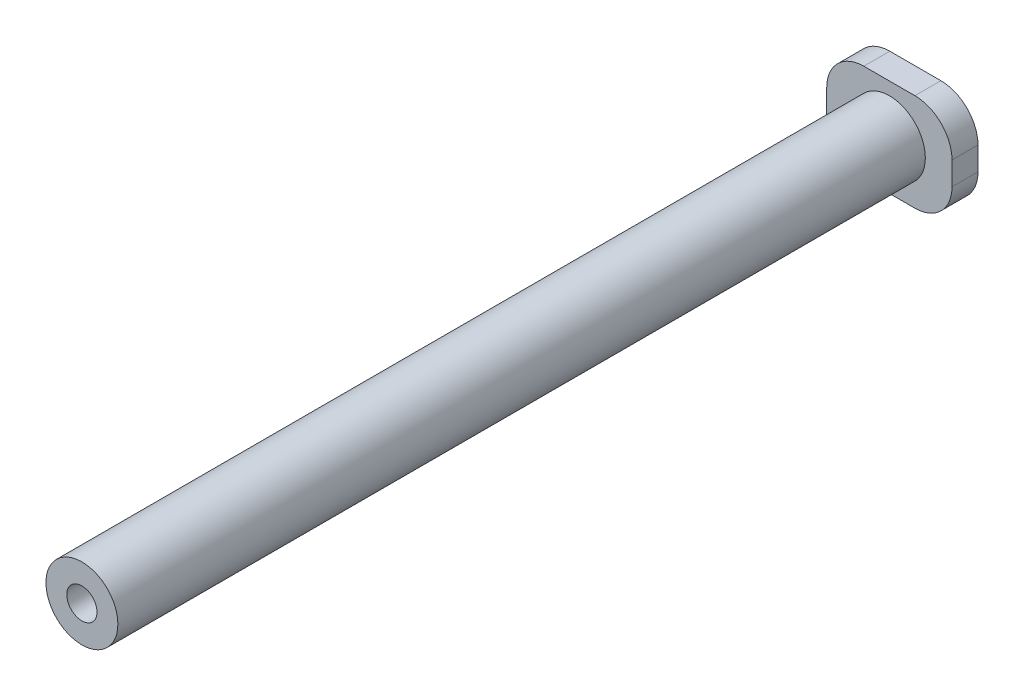
ISO-10303-21;
HEADER;
FILE_DESCRIPTION(('STEP AP214'),'2;1');
FILE_NAME('part.step','',(''),(''),'','','');
FILE_SCHEMA(('AUTOMOTIVE_DESIGN { 1 0 10303 214 1 1 1 1 }'));
ENDSEC;
DATA;
#1=APPLICATION_CONTEXT('core data for automotive mechanical design processes');
#2=APPLICATION_PROTOCOL_DEFINITION('international standard','automotive_design',2000,#1);
#3=PRODUCT_CONTEXT('',#1,'mechanical');
#4=PRODUCT('Part','Part','',(#3));
#5=PRODUCT_RELATED_PRODUCT_CATEGORY('part','',(#4));
#6=PRODUCT_DEFINITION_FORMATION('','',#4);
#7=PRODUCT_DEFINITION_CONTEXT('part definition',#1,'design');
#8=PRODUCT_DEFINITION('design','',#6,#7);
#9=PRODUCT_DEFINITION_SHAPE('','',#8);
#10=(LENGTH_UNIT() NAMED_UNIT(*) SI_UNIT(.MILLI.,.METRE.));
#11=(NAMED_UNIT(*) PLANE_ANGLE_UNIT() SI_UNIT($,.RADIAN.));
#12=(NAMED_UNIT(*) SI_UNIT($,.STERADIAN.) SOLID_ANGLE_UNIT());
#13=UNCERTAINTY_MEASURE_WITH_UNIT(LENGTH_MEASURE(1.E-05),#10,'distance_accuracy_value','');
#14=(GEOMETRIC_REPRESENTATION_CONTEXT(3) GLOBAL_UNCERTAINTY_ASSIGNED_CONTEXT((#13)) GLOBAL_UNIT_ASSIGNED_CONTEXT((#10,
#11,#12)) REPRESENTATION_CONTEXT('',''));
#15=CARTESIAN_POINT('',(0.,0.,0.));
#16=DIRECTION('',(0.,0.,1.));
#17=DIRECTION('',(1.,0.,0.));
#18=AXIS2_PLACEMENT_3D('',#15,#16,#17);
#19=CARTESIAN_POINT('',(0.,0.,2.8));
#20=DIRECTION('',(1.,0.,0.));
#21=DIRECTION('',(0.,0.,-1.));
#22=AXIS2_PLACEMENT_3D('',#19,#20,#21);
#23=PLANE('',#22);
#24=DIRECTION('',(0.,-1.,0.));
#25=VECTOR('',#24,1.);
#26=CARTESIAN_POINT('',(0.,0.,0.));
#27=LINE('',#26,#25);
#28=CARTESIAN_POINT('',(0.,6.5,0.));
#29=VERTEX_POINT('',#28);
#30=CARTESIAN_POINT('',(0.,4.,0.));
#31=VERTEX_POINT('',#30);
#32=EDGE_CURVE('E133',#29,#31,#27,.T.);
#33=ORIENTED_EDGE('',*,*,#32,.T.);
#34=DIRECTION('',(0.,0.,-1.));
#35=VECTOR('',#34,1.);
#36=CARTESIAN_POINT('',(0.,4.,2.8));
#37=LINE('',#36,#35);
#38=CARTESIAN_POINT('',(0.,4.,2.8));
#39=VERTEX_POINT('',#38);
#40=EDGE_CURVE('E156',#31,#39,#37,.F.);
#41=ORIENTED_EDGE('',*,*,#40,.T.);
#42=DIRECTION('',(0.,-1.,0.));
#43=VECTOR('',#42,1.);
#44=CARTESIAN_POINT('',(0.,0.,2.8));
#45=LINE('',#44,#43);
#46=CARTESIAN_POINT('',(0.,6.5,2.8));
#47=VERTEX_POINT('',#46);
#48=EDGE_CURVE('E131',#47,#39,#45,.T.);
#49=ORIENTED_EDGE('',*,*,#48,.F.);
#50=DIRECTION('',(0.,0.,-1.));
#51=VECTOR('',#50,1.);
#52=CARTESIAN_POINT('',(0.,6.5,2.8));
#53=LINE('',#52,#51);
#54=EDGE_CURVE('E153',#47,#29,#53,.T.);
#55=ORIENTED_EDGE('',*,*,#54,.T.);
#56=EDGE_LOOP('',(#33,#41,#49,#55));
#57=FACE_BOUND('',#56,.T.);
#58=ADVANCED_FACE('F38',(#57),#23,.F.);
#59=CARTESIAN_POINT('',(0.,0.,2.8));
#60=DIRECTION('',(0.,1.,0.));
#61=DIRECTION('',(0.,0.,1.));
#62=AXIS2_PLACEMENT_3D('',#59,#60,#61);
#63=PLANE('',#62);
#64=DIRECTION('',(1.,0.,0.));
#65=VECTOR('',#64,1.);
#66=CARTESIAN_POINT('',(0.,0.,0.));
#67=LINE('',#66,#65);
#68=CARTESIAN_POINT('',(4.,0.,0.));
#69=VERTEX_POINT('',#68);
#70=CARTESIAN_POINT('',(9.5,0.,0.));
#71=VERTEX_POINT('',#70);
#72=EDGE_CURVE('E129',#69,#71,#67,.T.);
#73=ORIENTED_EDGE('',*,*,#72,.T.);
#74=DIRECTION('',(0.,0.,-1.));
#75=VECTOR('',#74,1.);
#76=CARTESIAN_POINT('',(9.5,0.,2.8));
#77=LINE('',#76,#75);
#78=CARTESIAN_POINT('',(9.5,0.,2.8));
#79=VERTEX_POINT('',#78);
#80=EDGE_CURVE('E108',#71,#79,#77,.F.);
#81=ORIENTED_EDGE('',*,*,#80,.T.);
#82=DIRECTION('',(1.,0.,0.));
#83=VECTOR('',#82,1.);
#84=CARTESIAN_POINT('',(0.,0.,2.8));
#85=LINE('',#84,#83);
#86=CARTESIAN_POINT('',(4.,0.,2.8));
#87=VERTEX_POINT('',#86);
#88=EDGE_CURVE('E173',#87,#79,#85,.T.);
#89=ORIENTED_EDGE('',*,*,#88,.F.);
#90=DIRECTION('',(0.,0.,-1.));
#91=VECTOR('',#90,1.);
#92=CARTESIAN_POINT('',(4.,0.,2.8));
#93=LINE('',#92,#91);
#94=EDGE_CURVE('E113',#87,#69,#93,.T.);
#95=ORIENTED_EDGE('',*,*,#94,.T.);
#96=EDGE_LOOP('',(#73,#81,#89,#95));
#97=FACE_BOUND('',#96,.T.);
#98=ADVANCED_FACE('F208',(#97),#63,.F.);
#99=CARTESIAN_POINT('',(13.5,0.,2.8));
#100=DIRECTION('',(-1.,0.,0.));
#101=DIRECTION('',(0.,0.,1.));
#102=AXIS2_PLACEMENT_3D('',#99,#100,#101);
#103=PLANE('',#102);
#104=DIRECTION('',(0.,1.,0.));
#105=VECTOR('',#104,1.);
#106=CARTESIAN_POINT('',(13.5,0.,2.8));
#107=LINE('',#106,#105);
#108=CARTESIAN_POINT('',(13.5,4.,2.8));
#109=VERTEX_POINT('',#108);
#110=CARTESIAN_POINT('',(13.5,6.5,2.8));
#111=VERTEX_POINT('',#110);
#112=EDGE_CURVE('E122',#109,#111,#107,.T.);
#113=ORIENTED_EDGE('',*,*,#112,.F.);
#114=DIRECTION('',(0.,0.,-1.));
#115=VECTOR('',#114,1.);
#116=CARTESIAN_POINT('',(13.5,4.,2.8));
#117=LINE('',#116,#115);
#118=CARTESIAN_POINT('',(13.5,4.,0.));
#119=VERTEX_POINT('',#118);
#120=EDGE_CURVE('E107',#109,#119,#117,.T.);
#121=ORIENTED_EDGE('',*,*,#120,.T.);
#122=DIRECTION('',(0.,1.,0.));
#123=VECTOR('',#122,1.);
#124=CARTESIAN_POINT('',(13.5,0.,0.));
#125=LINE('',#124,#123);
#126=CARTESIAN_POINT('',(13.5,6.5,0.));
#127=VERTEX_POINT('',#126);
#128=EDGE_CURVE('E120',#119,#127,#125,.T.);
#129=ORIENTED_EDGE('',*,*,#128,.T.);
#130=DIRECTION('',(0.,0.,-1.));
#131=VECTOR('',#130,1.);
#132=CARTESIAN_POINT('',(13.5,6.5,2.8));
#133=LINE('',#132,#131);
#134=EDGE_CURVE('E124',#127,#111,#133,.F.);
#135=ORIENTED_EDGE('',*,*,#134,.T.);
#136=EDGE_LOOP('',(#113,#121,#129,#135));
#137=FACE_BOUND('',#136,.T.);
#138=ADVANCED_FACE('F119',(#137),#103,.F.);
#139=CARTESIAN_POINT('',(0.,10.5,2.8));
#140=DIRECTION('',(0.,-1.,0.));
#141=DIRECTION('',(0.,0.,-1.));
#142=AXIS2_PLACEMENT_3D('',#139,#140,#141);
#143=PLANE('',#142);
#144=DIRECTION('',(-1.,0.,0.));
#145=VECTOR('',#144,1.);
#146=CARTESIAN_POINT('',(0.,10.5,0.));
#147=LINE('',#146,#145);
#148=CARTESIAN_POINT('',(9.5,10.5,0.));
#149=VERTEX_POINT('',#148);
#150=CARTESIAN_POINT('',(4.,10.5,0.));
#151=VERTEX_POINT('',#150);
#152=EDGE_CURVE('E128',#149,#151,#147,.T.);
#153=ORIENTED_EDGE('',*,*,#152,.T.);
#154=DIRECTION('',(0.,0.,-1.));
#155=VECTOR('',#154,1.);
#156=CARTESIAN_POINT('',(4.,10.5,2.8));
#157=LINE('',#156,#155);
#158=CARTESIAN_POINT('',(4.,10.5,2.8));
#159=VERTEX_POINT('',#158);
#160=EDGE_CURVE('E11',#151,#159,#157,.F.);
#161=ORIENTED_EDGE('',*,*,#160,.T.);
#162=DIRECTION('',(-1.,0.,0.));
#163=VECTOR('',#162,1.);
#164=CARTESIAN_POINT('',(0.,10.5,2.8));
#165=LINE('',#164,#163);
#166=CARTESIAN_POINT('',(9.5,10.5,2.8));
#167=VERTEX_POINT('',#166);
#168=EDGE_CURVE('E160',#167,#159,#165,.T.);
#169=ORIENTED_EDGE('',*,*,#168,.F.);
#170=DIRECTION('',(0.,0.,-1.));
#171=VECTOR('',#170,1.);
#172=CARTESIAN_POINT('',(9.5,10.5,2.8));
#173=LINE('',#172,#171);
#174=EDGE_CURVE('E46',#167,#149,#173,.T.);
#175=ORIENTED_EDGE('',*,*,#174,.T.);
#176=EDGE_LOOP('',(#153,#161,#169,#175));
#177=FACE_BOUND('',#176,.T.);
#178=ADVANCED_FACE('F159',(#177),#143,.F.);
#179=CARTESIAN_POINT('',(0.,0.,2.8));
#180=DIRECTION('',(0.,0.,-1.));
#181=DIRECTION('',(-1.,0.,0.));
#182=AXIS2_PLACEMENT_3D('',#179,#180,#181);
#183=PLANE('',#182);
#184=CARTESIAN_POINT('',(6.75,5.25,2.8));
#185=DIRECTION('',(0.,0.,1.));
#186=DIRECTION('',(1.,0.,0.));
#187=AXIS2_PLACEMENT_3D('',#184,#185,#186);
#188=CIRCLE('',#187,3.875);
#189=CARTESIAN_POINT('',(10.625,5.25,2.8));
#190=VERTEX_POINT('',#189);
#191=EDGE_CURVE('E137',#190,#190,#188,.T.);
#192=ORIENTED_EDGE('',*,*,#191,.F.);
#193=EDGE_LOOP('',(#192));
#194=FACE_BOUND('',#193,.T.);
#195=ORIENTED_EDGE('',*,*,#88,.T.);
#196=CARTESIAN_POINT('',(9.5,4.,2.8));
#197=DIRECTION('',(0.,0.,-1.));
#198=DIRECTION('',(-1.,0.,0.));
#199=AXIS2_PLACEMENT_3D('',#196,#197,#198);
#200=CIRCLE('',#199,4.);
#201=EDGE_CURVE('E151',#79,#109,#200,.F.);
#202=ORIENTED_EDGE('',*,*,#201,.T.);
#203=ORIENTED_EDGE('',*,*,#112,.T.);
#204=CARTESIAN_POINT('',(9.5,6.5,2.8));
#205=DIRECTION('',(0.,0.,-1.));
#206=DIRECTION('',(-1.,0.,0.));
#207=AXIS2_PLACEMENT_3D('',#204,#205,#206);
#208=CIRCLE('',#207,4.);
#209=EDGE_CURVE('E58',#111,#167,#208,.F.);
#210=ORIENTED_EDGE('',*,*,#209,.T.);
#211=ORIENTED_EDGE('',*,*,#168,.T.);
#212=CARTESIAN_POINT('',(4.,6.5,2.8));
#213=DIRECTION('',(0.,0.,-1.));
#214=DIRECTION('',(-1.,0.,0.));
#215=AXIS2_PLACEMENT_3D('',#212,#213,#214);
#216=CIRCLE('',#215,4.);
#217=EDGE_CURVE('E147',#159,#47,#216,.F.);
#218=ORIENTED_EDGE('',*,*,#217,.T.);
#219=ORIENTED_EDGE('',*,*,#48,.T.);
#220=CARTESIAN_POINT('',(4.,4.,2.8));
#221=DIRECTION('',(0.,0.,-1.));
#222=DIRECTION('',(-1.,0.,0.));
#223=AXIS2_PLACEMENT_3D('',#220,#221,#222);
#224=CIRCLE('',#223,4.);
#225=EDGE_CURVE('E149',#39,#87,#224,.F.);
#226=ORIENTED_EDGE('',*,*,#225,.T.);
#227=EDGE_LOOP('',(#195,#202,#203,#210,#211,#218,#219,#226));
#228=FACE_BOUND('',#227,.T.);
#229=ADVANCED_FACE('F228',(#194,#228),#183,.F.);
#230=CARTESIAN_POINT('',(0.,0.,0.));
#231=DIRECTION('',(0.,0.,-1.));
#232=DIRECTION('',(-1.,0.,0.));
#233=AXIS2_PLACEMENT_3D('',#230,#231,#232);
#234=PLANE('',#233);
#235=CARTESIAN_POINT('',(6.75,5.25,0.));
#236=DIRECTION('',(0.,0.,1.));
#237=DIRECTION('',(1.,0.,0.));
#238=AXIS2_PLACEMENT_3D('',#235,#236,#237);
#239=CIRCLE('',#238,1.63);
#240=CARTESIAN_POINT('',(8.38,5.25,0.));
#241=VERTEX_POINT('',#240);
#242=EDGE_CURVE('E183',#241,#241,#239,.T.);
#243=ORIENTED_EDGE('',*,*,#242,.T.);
#244=EDGE_LOOP('',(#243));
#245=FACE_BOUND('',#244,.T.);
#246=ORIENTED_EDGE('',*,*,#128,.F.);
#247=CARTESIAN_POINT('',(9.5,4.,0.));
#248=DIRECTION('',(0.,0.,-1.));
#249=DIRECTION('',(-1.,0.,0.));
#250=AXIS2_PLACEMENT_3D('',#247,#248,#249);
#251=CIRCLE('',#250,4.);
#252=EDGE_CURVE('E103',#119,#71,#251,.T.);
#253=ORIENTED_EDGE('',*,*,#252,.T.);
#254=ORIENTED_EDGE('',*,*,#72,.F.);
#255=CARTESIAN_POINT('',(4.,4.,0.));
#256=DIRECTION('',(0.,0.,-1.));
#257=DIRECTION('',(-1.,0.,0.));
#258=AXIS2_PLACEMENT_3D('',#255,#256,#257);
#259=CIRCLE('',#258,4.);
#260=EDGE_CURVE('E114',#69,#31,#259,.T.);
#261=ORIENTED_EDGE('',*,*,#260,.T.);
#262=ORIENTED_EDGE('',*,*,#32,.F.);
#263=CARTESIAN_POINT('',(4.,6.5,0.));
#264=DIRECTION('',(0.,0.,-1.));
#265=DIRECTION('',(-1.,0.,0.));
#266=AXIS2_PLACEMENT_3D('',#263,#264,#265);
#267=CIRCLE('',#266,4.);
#268=EDGE_CURVE('E140',#29,#151,#267,.T.);
#269=ORIENTED_EDGE('',*,*,#268,.T.);
#270=ORIENTED_EDGE('',*,*,#152,.F.);
#271=CARTESIAN_POINT('',(9.5,6.5,0.));
#272=DIRECTION('',(0.,0.,-1.));
#273=DIRECTION('',(-1.,0.,0.));
#274=AXIS2_PLACEMENT_3D('',#271,#272,#273);
#275=CIRCLE('',#274,4.);
#276=EDGE_CURVE('E123',#149,#127,#275,.T.);
#277=ORIENTED_EDGE('',*,*,#276,.T.);
#278=EDGE_LOOP('',(#246,#253,#254,#261,#262,#269,#270,#277));
#279=FACE_BOUND('',#278,.T.);
#280=ADVANCED_FACE('F126',(#245,#279),#234,.T.);
#281=CARTESIAN_POINT('',(6.75,5.25,89.8));
#282=DIRECTION('',(0.,0.,-1.));
#283=DIRECTION('',(-1.,0.,0.));
#284=AXIS2_PLACEMENT_3D('',#281,#282,#283);
#285=CYLINDRICAL_SURFACE('',#284,3.875);
#286=CARTESIAN_POINT('',(6.75,5.25,89.8));
#287=DIRECTION('',(0.,0.,1.));
#288=DIRECTION('',(1.,0.,0.));
#289=AXIS2_PLACEMENT_3D('',#286,#287,#288);
#290=CIRCLE('',#289,3.875);
#291=CARTESIAN_POINT('',(10.625,5.25,89.8));
#292=VERTEX_POINT('',#291);
#293=EDGE_CURVE('E181',#292,#292,#290,.T.);
#294=ORIENTED_EDGE('',*,*,#293,.F.);
#295=EDGE_LOOP('',(#294));
#296=FACE_BOUND('',#295,.T.);
#297=ORIENTED_EDGE('',*,*,#191,.T.);
#298=EDGE_LOOP('',(#297));
#299=FACE_BOUND('',#298,.T.);
#300=ADVANCED_FACE('F197',(#296,#299),#285,.T.);
#301=CARTESIAN_POINT('',(6.75,5.25,89.8));
#302=DIRECTION('',(0.,0.,1.));
#303=DIRECTION('',(1.,0.,0.));
#304=AXIS2_PLACEMENT_3D('',#301,#302,#303);
#305=PLANE('',#304);
#306=CARTESIAN_POINT('',(6.75,5.25,89.8));
#307=DIRECTION('',(0.,0.,1.));
#308=DIRECTION('',(1.,0.,0.));
#309=AXIS2_PLACEMENT_3D('',#306,#307,#308);
#310=CIRCLE('',#309,1.63);
#311=CARTESIAN_POINT('',(8.38,5.25,89.8));
#312=VERTEX_POINT('',#311);
#313=EDGE_CURVE('E187',#312,#312,#310,.T.);
#314=ORIENTED_EDGE('',*,*,#313,.F.);
#315=EDGE_LOOP('',(#314));
#316=FACE_BOUND('',#315,.T.);
#317=ORIENTED_EDGE('',*,*,#293,.T.);
#318=EDGE_LOOP('',(#317));
#319=FACE_BOUND('',#318,.T.);
#320=ADVANCED_FACE('F195',(#316,#319),#305,.T.);
#321=CARTESIAN_POINT('',(6.75,5.25,0.));
#322=DIRECTION('',(0.,0.,1.));
#323=DIRECTION('',(1.,0.,0.));
#324=AXIS2_PLACEMENT_3D('',#321,#322,#323);
#325=CYLINDRICAL_SURFACE('',#324,1.63);
#326=ORIENTED_EDGE('',*,*,#242,.F.);
#327=EDGE_LOOP('',(#326));
#328=FACE_BOUND('',#327,.T.);
#329=ORIENTED_EDGE('',*,*,#313,.T.);
#330=EDGE_LOOP('',(#329));
#331=FACE_BOUND('',#330,.T.);
#332=ADVANCED_FACE('F193',(#328,#331),#325,.F.);
#333=CARTESIAN_POINT('',(9.5,4.,2.8));
#334=DIRECTION('',(0.,0.,-1.));
#335=DIRECTION('',(-1.,0.,0.));
#336=AXIS2_PLACEMENT_3D('',#333,#334,#335);
#337=CYLINDRICAL_SURFACE('',#336,4.);
#338=ORIENTED_EDGE('',*,*,#201,.F.);
#339=ORIENTED_EDGE('',*,*,#80,.F.);
#340=ORIENTED_EDGE('',*,*,#252,.F.);
#341=ORIENTED_EDGE('',*,*,#120,.F.);
#342=EDGE_LOOP('',(#338,#339,#340,#341));
#343=FACE_BOUND('',#342,.T.);
#344=ADVANCED_FACE('F106',(#343),#337,.T.);
#345=CARTESIAN_POINT('',(4.,4.,2.8));
#346=DIRECTION('',(0.,0.,-1.));
#347=DIRECTION('',(-1.,0.,0.));
#348=AXIS2_PLACEMENT_3D('',#345,#346,#347);
#349=CYLINDRICAL_SURFACE('',#348,4.);
#350=ORIENTED_EDGE('',*,*,#225,.F.);
#351=ORIENTED_EDGE('',*,*,#40,.F.);
#352=ORIENTED_EDGE('',*,*,#260,.F.);
#353=ORIENTED_EDGE('',*,*,#94,.F.);
#354=EDGE_LOOP('',(#350,#351,#352,#353));
#355=FACE_BOUND('',#354,.T.);
#356=ADVANCED_FACE('F219',(#355),#349,.T.);
#357=CARTESIAN_POINT('',(4.,6.5,2.8));
#358=DIRECTION('',(0.,0.,-1.));
#359=DIRECTION('',(-1.,0.,0.));
#360=AXIS2_PLACEMENT_3D('',#357,#358,#359);
#361=CYLINDRICAL_SURFACE('',#360,4.);
#362=ORIENTED_EDGE('',*,*,#217,.F.);
#363=ORIENTED_EDGE('',*,*,#160,.F.);
#364=ORIENTED_EDGE('',*,*,#268,.F.);
#365=ORIENTED_EDGE('',*,*,#54,.F.);
#366=EDGE_LOOP('',(#362,#363,#364,#365));
#367=FACE_BOUND('',#366,.T.);
#368=ADVANCED_FACE('F167',(#367),#361,.T.);
#369=CARTESIAN_POINT('',(9.5,6.5,2.8));
#370=DIRECTION('',(0.,0.,-1.));
#371=DIRECTION('',(-1.,0.,0.));
#372=AXIS2_PLACEMENT_3D('',#369,#370,#371);
#373=CYLINDRICAL_SURFACE('',#372,4.);
#374=ORIENTED_EDGE('',*,*,#209,.F.);
#375=ORIENTED_EDGE('',*,*,#134,.F.);
#376=ORIENTED_EDGE('',*,*,#276,.F.);
#377=ORIENTED_EDGE('',*,*,#174,.F.);
#378=EDGE_LOOP('',(#374,#375,#376,#377));
#379=FACE_BOUND('',#378,.T.);
#380=ADVANCED_FACE('F40',(#379),#373,.T.);
#381=CLOSED_SHELL('',(#58,#98,#138,#178,#229,#280,#300,#320,#332,#344,#356,#368,#380));
#382=MANIFOLD_SOLID_BREP('B2',#381);
#383=ADVANCED_BREP_SHAPE_REPRESENTATION('',(#18,#382),#14);
#384=SHAPE_DEFINITION_REPRESENTATION(#9,#383);
ENDSEC;
END-ISO-10303-21;
